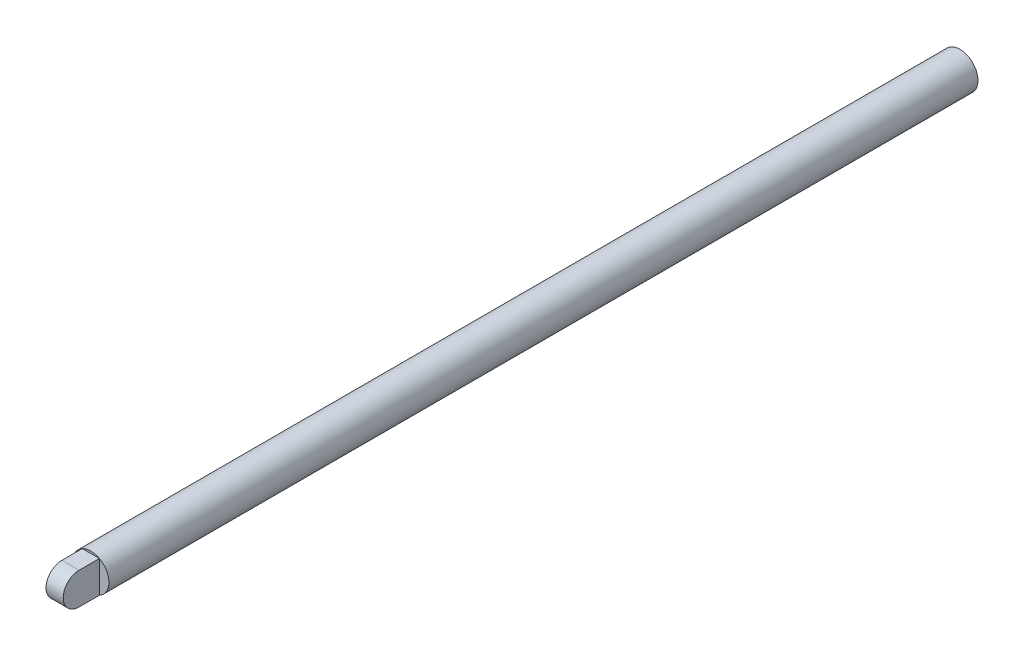
ISO-10303-21;
HEADER;
FILE_DESCRIPTION(('STEP AP214'),'2;1');
FILE_NAME('part.step','',(''),(''),'','','');
FILE_SCHEMA(('AUTOMOTIVE_DESIGN { 1 0 10303 214 1 1 1 1 }'));
ENDSEC;
DATA;
#1=APPLICATION_CONTEXT('core data for automotive mechanical design processes');
#2=APPLICATION_PROTOCOL_DEFINITION('international standard','automotive_design',2000,#1);
#3=PRODUCT_CONTEXT('',#1,'mechanical');
#4=PRODUCT('Part','Part','',(#3));
#5=PRODUCT_RELATED_PRODUCT_CATEGORY('part','',(#4));
#6=PRODUCT_DEFINITION_FORMATION('','',#4);
#7=PRODUCT_DEFINITION_CONTEXT('part definition',#1,'design');
#8=PRODUCT_DEFINITION('design','',#6,#7);
#9=PRODUCT_DEFINITION_SHAPE('','',#8);
#10=(LENGTH_UNIT() NAMED_UNIT(*) SI_UNIT(.MILLI.,.METRE.));
#11=(NAMED_UNIT(*) PLANE_ANGLE_UNIT() SI_UNIT($,.RADIAN.));
#12=(NAMED_UNIT(*) SI_UNIT($,.STERADIAN.) SOLID_ANGLE_UNIT());
#13=UNCERTAINTY_MEASURE_WITH_UNIT(LENGTH_MEASURE(1.E-05),#10,'distance_accuracy_value','');
#14=(GEOMETRIC_REPRESENTATION_CONTEXT(3) GLOBAL_UNCERTAINTY_ASSIGNED_CONTEXT((#13)) GLOBAL_UNIT_ASSIGNED_CONTEXT((#10,
#11,#12)) REPRESENTATION_CONTEXT('',''));
#15=CARTESIAN_POINT('',(0.,0.,0.));
#16=DIRECTION('',(0.,0.,1.));
#17=DIRECTION('',(1.,0.,0.));
#18=AXIS2_PLACEMENT_3D('',#15,#16,#17);
#19=CARTESIAN_POINT('',(1.50804144505381,0.,79.756));
#20=DIRECTION('',(-1.,0.,0.));
#21=DIRECTION('',(0.,0.,1.));
#22=AXIS2_PLACEMENT_3D('',#19,#20,#21);
#23=CYLINDRICAL_SURFACE('',#22,2.794);
#24=CARTESIAN_POINT('',(-1.50804144505381,0.,79.756));
#25=DIRECTION('',(-1.,0.,0.));
#26=DIRECTION('',(0.,1.,0.));
#27=AXIS2_PLACEMENT_3D('',#24,#25,#26);
#28=CIRCLE('',#27,2.794);
#29=CARTESIAN_POINT('',(-1.50804144505381,-2.794,79.756));
#30=VERTEX_POINT('',#29);
#31=CARTESIAN_POINT('',(-1.50804144505381,2.794,79.756));
#32=VERTEX_POINT('',#31);
#33=EDGE_CURVE('E33',#30,#32,#28,.T.);
#34=ORIENTED_EDGE('',*,*,#33,.F.);
#35=DIRECTION('',(1.,0.,0.));
#36=VECTOR('',#35,1.);
#37=CARTESIAN_POINT('',(1.50804144505381,-2.794,79.756));
#38=LINE('',#37,#36);
#39=CARTESIAN_POINT('',(1.50804144505381,-2.794,79.756));
#40=VERTEX_POINT('',#39);
#41=EDGE_CURVE('E9',#30,#40,#38,.T.);
#42=ORIENTED_EDGE('',*,*,#41,.T.);
#43=CARTESIAN_POINT('',(1.50804144505381,0.,79.756));
#44=DIRECTION('',(1.,0.,0.));
#45=DIRECTION('',(0.,0.,1.));
#46=AXIS2_PLACEMENT_3D('',#43,#44,#45);
#47=CIRCLE('',#46,2.794);
#48=CARTESIAN_POINT('',(1.50804144505382,2.794,79.756));
#49=VERTEX_POINT('',#48);
#50=EDGE_CURVE('E87',#49,#40,#47,.T.);
#51=ORIENTED_EDGE('',*,*,#50,.F.);
#52=DIRECTION('',(1.,0.,0.));
#53=VECTOR('',#52,1.);
#54=CARTESIAN_POINT('',(1.50804144505382,2.794,79.756));
#55=LINE('',#54,#53);
#56=EDGE_CURVE('E86',#32,#49,#55,.T.);
#57=ORIENTED_EDGE('',*,*,#56,.F.);
#58=EDGE_LOOP('',(#34,#42,#51,#57));
#59=FACE_BOUND('',#58,.T.);
#60=ADVANCED_FACE('F15',(#59),#23,.T.);
#61=CARTESIAN_POINT('',(1.50804144505381,-2.794,76.2));
#62=DIRECTION('',(0.,-1.,0.));
#63=DIRECTION('',(1.,0.,0.));
#64=AXIS2_PLACEMENT_3D('',#61,#62,#63);
#65=PLANE('',#64);
#66=ORIENTED_EDGE('',*,*,#41,.F.);
#67=DIRECTION('',(0.,0.,1.));
#68=VECTOR('',#67,1.);
#69=CARTESIAN_POINT('',(-1.50804144505381,-2.794,76.2));
#70=LINE('',#69,#68);
#71=CARTESIAN_POINT('',(-1.50804144505381,-2.794,76.2));
#72=VERTEX_POINT('',#71);
#73=EDGE_CURVE('E102',#72,#30,#70,.T.);
#74=ORIENTED_EDGE('',*,*,#73,.F.);
#75=DIRECTION('',(-1.,0.,0.));
#76=VECTOR('',#75,1.);
#77=CARTESIAN_POINT('',(0.754020722526907,-2.794,76.2));
#78=LINE('',#77,#76);
#79=CARTESIAN_POINT('',(1.50804144505381,-2.794,76.2));
#80=VERTEX_POINT('',#79);
#81=EDGE_CURVE('E76',#80,#72,#78,.T.);
#82=ORIENTED_EDGE('',*,*,#81,.F.);
#83=DIRECTION('',(0.,0.,1.));
#84=VECTOR('',#83,1.);
#85=CARTESIAN_POINT('',(1.50804144505381,-2.794,76.2));
#86=LINE('',#85,#84);
#87=EDGE_CURVE('E25',#80,#40,#86,.T.);
#88=ORIENTED_EDGE('',*,*,#87,.T.);
#89=EDGE_LOOP('',(#66,#74,#82,#88));
#90=FACE_BOUND('',#89,.T.);
#91=ADVANCED_FACE('F112',(#90),#65,.T.);
#92=CARTESIAN_POINT('',(-1.50804144505381,-2.794,76.2));
#93=DIRECTION('',(-1.,0.,0.));
#94=DIRECTION('',(0.,-1.,0.));
#95=AXIS2_PLACEMENT_3D('',#92,#93,#94);
#96=PLANE('',#95);
#97=ORIENTED_EDGE('',*,*,#33,.T.);
#98=DIRECTION('',(0.,0.,1.));
#99=VECTOR('',#98,1.);
#100=CARTESIAN_POINT('',(-1.50804144505381,2.794,76.2));
#101=LINE('',#100,#99);
#102=CARTESIAN_POINT('',(-1.50804144505381,2.794,76.2));
#103=VERTEX_POINT('',#102);
#104=EDGE_CURVE('E97',#103,#32,#101,.T.);
#105=ORIENTED_EDGE('',*,*,#104,.F.);
#106=DIRECTION('',(0.,1.,0.));
#107=VECTOR('',#106,1.);
#108=CARTESIAN_POINT('',(-1.50804144505381,-1.397,76.2));
#109=LINE('',#108,#107);
#110=EDGE_CURVE('E93',#72,#103,#109,.T.);
#111=ORIENTED_EDGE('',*,*,#110,.F.);
#112=ORIENTED_EDGE('',*,*,#73,.T.);
#113=EDGE_LOOP('',(#97,#105,#111,#112));
#114=FACE_BOUND('',#113,.T.);
#115=ADVANCED_FACE('F108',(#114),#96,.T.);
#116=CARTESIAN_POINT('',(-1.50804144505381,2.794,76.2));
#117=DIRECTION('',(0.,1.,0.));
#118=DIRECTION('',(0.,0.,1.));
#119=AXIS2_PLACEMENT_3D('',#116,#117,#118);
#120=PLANE('',#119);
#121=ORIENTED_EDGE('',*,*,#56,.T.);
#122=DIRECTION('',(0.,0.,1.));
#123=VECTOR('',#122,1.);
#124=CARTESIAN_POINT('',(1.50804144505382,2.794,76.2));
#125=LINE('',#124,#123);
#126=CARTESIAN_POINT('',(1.50804144505382,2.794,76.2));
#127=VERTEX_POINT('',#126);
#128=EDGE_CURVE('E71',#127,#49,#125,.T.);
#129=ORIENTED_EDGE('',*,*,#128,.F.);
#130=DIRECTION('',(1.,0.,0.));
#131=VECTOR('',#130,1.);
#132=CARTESIAN_POINT('',(-0.754020722526907,2.794,76.2));
#133=LINE('',#132,#131);
#134=EDGE_CURVE('E75',#103,#127,#133,.T.);
#135=ORIENTED_EDGE('',*,*,#134,.F.);
#136=ORIENTED_EDGE('',*,*,#104,.T.);
#137=EDGE_LOOP('',(#121,#129,#135,#136));
#138=FACE_BOUND('',#137,.T.);
#139=ADVANCED_FACE('F85',(#138),#120,.T.);
#140=CARTESIAN_POINT('',(1.50804144505382,2.794,76.2));
#141=DIRECTION('',(1.,0.,0.));
#142=DIRECTION('',(0.,1.,0.));
#143=AXIS2_PLACEMENT_3D('',#140,#141,#142);
#144=PLANE('',#143);
#145=ORIENTED_EDGE('',*,*,#50,.T.);
#146=ORIENTED_EDGE('',*,*,#87,.F.);
#147=DIRECTION('',(0.,-1.,0.));
#148=VECTOR('',#147,1.);
#149=CARTESIAN_POINT('',(1.50804144505382,1.397,76.2));
#150=LINE('',#149,#148);
#151=EDGE_CURVE('E68',#127,#80,#150,.T.);
#152=ORIENTED_EDGE('',*,*,#151,.F.);
#153=ORIENTED_EDGE('',*,*,#128,.T.);
#154=EDGE_LOOP('',(#145,#146,#152,#153));
#155=FACE_BOUND('',#154,.T.);
#156=ADVANCED_FACE('F69',(#155),#144,.T.);
#157=CARTESIAN_POINT('',(0.,0.,76.2));
#158=DIRECTION('',(0.,0.,-1.));
#159=DIRECTION('',(-1.,0.,0.));
#160=AXIS2_PLACEMENT_3D('',#157,#158,#159);
#161=PLANE('',#160);
#162=ORIENTED_EDGE('',*,*,#134,.T.);
#163=CARTESIAN_POINT('',(0.,0.,76.2));
#164=DIRECTION('',(0.,0.,-1.));
#165=DIRECTION('',(0.,-1.,0.));
#166=AXIS2_PLACEMENT_3D('',#163,#164,#165);
#167=CIRCLE('',#166,3.175);
#168=EDGE_CURVE('E53',#103,#127,#167,.T.);
#169=ORIENTED_EDGE('',*,*,#168,.F.);
#170=EDGE_LOOP('',(#162,#169));
#171=FACE_BOUND('',#170,.T.);
#172=ADVANCED_FACE('F79',(#171),#161,.F.);
#173=CARTESIAN_POINT('',(0.,0.,76.2));
#174=DIRECTION('',(0.,0.,-1.));
#175=DIRECTION('',(-1.,0.,0.));
#176=AXIS2_PLACEMENT_3D('',#173,#174,#175);
#177=PLANE('',#176);
#178=ORIENTED_EDGE('',*,*,#151,.T.);
#179=CARTESIAN_POINT('',(0.,0.,76.2));
#180=DIRECTION('',(0.,0.,-1.));
#181=DIRECTION('',(0.,-1.,0.));
#182=AXIS2_PLACEMENT_3D('',#179,#180,#181);
#183=CIRCLE('',#182,3.175);
#184=EDGE_CURVE('E59',#127,#80,#183,.T.);
#185=ORIENTED_EDGE('',*,*,#184,.F.);
#186=EDGE_LOOP('',(#178,#185));
#187=FACE_BOUND('',#186,.T.);
#188=ADVANCED_FACE('F89',(#187),#177,.F.);
#189=CARTESIAN_POINT('',(0.,0.,76.2));
#190=DIRECTION('',(0.,0.,-1.));
#191=DIRECTION('',(-1.,0.,0.));
#192=AXIS2_PLACEMENT_3D('',#189,#190,#191);
#193=PLANE('',#192);
#194=ORIENTED_EDGE('',*,*,#81,.T.);
#195=CARTESIAN_POINT('',(0.,0.,76.2));
#196=DIRECTION('',(0.,0.,-1.));
#197=DIRECTION('',(0.,-1.,0.));
#198=AXIS2_PLACEMENT_3D('',#195,#196,#197);
#199=CIRCLE('',#198,3.175);
#200=EDGE_CURVE('E90',#80,#72,#199,.T.);
#201=ORIENTED_EDGE('',*,*,#200,.F.);
#202=EDGE_LOOP('',(#194,#201));
#203=FACE_BOUND('',#202,.T.);
#204=ADVANCED_FACE('F117',(#203),#193,.F.);
#205=CARTESIAN_POINT('',(0.,0.,76.2));
#206=DIRECTION('',(0.,0.,-1.));
#207=DIRECTION('',(-1.,0.,0.));
#208=AXIS2_PLACEMENT_3D('',#205,#206,#207);
#209=PLANE('',#208);
#210=ORIENTED_EDGE('',*,*,#110,.T.);
#211=CARTESIAN_POINT('',(0.,0.,76.2));
#212=DIRECTION('',(0.,0.,-1.));
#213=DIRECTION('',(0.,-1.,0.));
#214=AXIS2_PLACEMENT_3D('',#211,#212,#213);
#215=CIRCLE('',#214,3.175);
#216=EDGE_CURVE('E62',#72,#103,#215,.T.);
#217=ORIENTED_EDGE('',*,*,#216,.F.);
#218=EDGE_LOOP('',(#210,#217));
#219=FACE_BOUND('',#218,.T.);
#220=ADVANCED_FACE('F114',(#219),#209,.F.);
#221=CARTESIAN_POINT('',(0.,0.,-76.2));
#222=DIRECTION('',(0.,0.,-1.));
#223=DIRECTION('',(-1.,0.,0.));
#224=AXIS2_PLACEMENT_3D('',#221,#222,#223);
#225=PLANE('',#224);
#226=CARTESIAN_POINT('',(0.,0.,-76.2));
#227=DIRECTION('',(0.,0.,1.));
#228=DIRECTION('',(1.,0.,0.));
#229=AXIS2_PLACEMENT_3D('',#226,#227,#228);
#230=CIRCLE('',#229,3.175);
#231=CARTESIAN_POINT('',(3.175,0.,-76.2));
#232=VERTEX_POINT('',#231);
#233=EDGE_CURVE('E19',#232,#232,#230,.T.);
#234=ORIENTED_EDGE('',*,*,#233,.F.);
#235=EDGE_LOOP('',(#234));
#236=FACE_BOUND('',#235,.T.);
#237=ADVANCED_FACE('F116',(#236),#225,.T.);
#238=CARTESIAN_POINT('',(0.,0.,0.));
#239=DIRECTION('',(0.,0.,1.));
#240=DIRECTION('',(1.,0.,0.));
#241=AXIS2_PLACEMENT_3D('',#238,#239,#240);
#242=CYLINDRICAL_SURFACE('',#241,3.175);
#243=ORIENTED_EDGE('',*,*,#233,.T.);
#244=EDGE_LOOP('',(#243));
#245=FACE_BOUND('',#244,.T.);
#246=ORIENTED_EDGE('',*,*,#184,.T.);
#247=ORIENTED_EDGE('',*,*,#200,.T.);
#248=ORIENTED_EDGE('',*,*,#216,.T.);
#249=ORIENTED_EDGE('',*,*,#168,.T.);
#250=EDGE_LOOP('',(#246,#247,#248,#249));
#251=FACE_BOUND('',#250,.T.);
#252=ADVANCED_FACE('F17',(#245,#251),#242,.T.);
#253=CLOSED_SHELL('',(#60,#91,#115,#139,#156,#172,#188,#204,#220,#237,#252));
#254=MANIFOLD_SOLID_BREP('B1',#253);
#255=ADVANCED_BREP_SHAPE_REPRESENTATION('',(#18,#254),#14);
#256=SHAPE_DEFINITION_REPRESENTATION(#9,#255);
ENDSEC;
END-ISO-10303-21;
